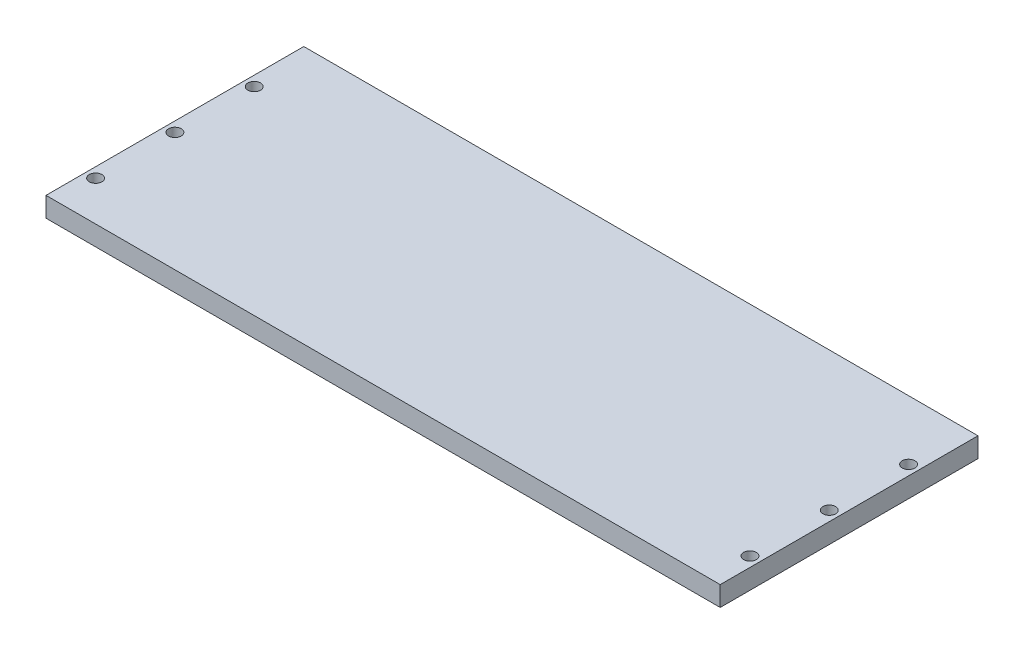
ISO-10303-21;
HEADER;
FILE_DESCRIPTION(('STEP AP214'),'2;1');
FILE_NAME('part.step','',(''),(''),'','','');
FILE_SCHEMA(('AUTOMOTIVE_DESIGN { 1 0 10303 214 1 1 1 1 }'));
ENDSEC;
DATA;
#1=APPLICATION_CONTEXT('core data for automotive mechanical design processes');
#2=APPLICATION_PROTOCOL_DEFINITION('international standard','automotive_design',2000,#1);
#3=PRODUCT_CONTEXT('',#1,'mechanical');
#4=PRODUCT('Part','Part','',(#3));
#5=PRODUCT_RELATED_PRODUCT_CATEGORY('part','',(#4));
#6=PRODUCT_DEFINITION_FORMATION('','',#4);
#7=PRODUCT_DEFINITION_CONTEXT('part definition',#1,'design');
#8=PRODUCT_DEFINITION('design','',#6,#7);
#9=PRODUCT_DEFINITION_SHAPE('','',#8);
#10=(LENGTH_UNIT() NAMED_UNIT(*) SI_UNIT(.MILLI.,.METRE.));
#11=(NAMED_UNIT(*) PLANE_ANGLE_UNIT() SI_UNIT($,.RADIAN.));
#12=(NAMED_UNIT(*) SI_UNIT($,.STERADIAN.) SOLID_ANGLE_UNIT());
#13=UNCERTAINTY_MEASURE_WITH_UNIT(LENGTH_MEASURE(1.E-05),#10,'distance_accuracy_value','');
#14=(GEOMETRIC_REPRESENTATION_CONTEXT(3) GLOBAL_UNCERTAINTY_ASSIGNED_CONTEXT((#13)) GLOBAL_UNIT_ASSIGNED_CONTEXT((#10,
#11,#12)) REPRESENTATION_CONTEXT('',''));
#15=CARTESIAN_POINT('',(0.,0.,0.));
#16=DIRECTION('',(0.,0.,1.));
#17=DIRECTION('',(1.,0.,0.));
#18=AXIS2_PLACEMENT_3D('',#15,#16,#17);
#19=CARTESIAN_POINT('',(0.,5.,0.));
#20=DIRECTION('',(0.,1.,0.));
#21=DIRECTION('',(0.,0.,1.));
#22=AXIS2_PLACEMENT_3D('',#19,#20,#21);
#23=PLANE('',#22);
#24=CARTESIAN_POINT('',(82.4999999999997,5.,2.49999999999998));
#25=DIRECTION('',(0.,1.,0.));
#26=DIRECTION('',(0.,0.,-1.));
#27=AXIS2_PLACEMENT_3D('',#24,#25,#26);
#28=CIRCLE('',#27,1.60000000000001);
#29=CARTESIAN_POINT('',(82.4999999999997,5.,0.899999999999973));
#30=VERTEX_POINT('',#29);
#31=EDGE_CURVE('E158',#30,#30,#28,.T.);
#32=ORIENTED_EDGE('',*,*,#31,.F.);
#33=EDGE_LOOP('',(#32));
#34=FACE_BOUND('',#33,.T.);
#35=CARTESIAN_POINT('',(-82.4999999999995,5.,22.5));
#36=DIRECTION('',(0.,1.,0.));
#37=DIRECTION('',(0.,0.,1.));
#38=AXIS2_PLACEMENT_3D('',#35,#36,#37);
#39=CIRCLE('',#38,1.6);
#40=CARTESIAN_POINT('',(-82.4999999999995,5.,24.1));
#41=VERTEX_POINT('',#40);
#42=EDGE_CURVE('E142',#41,#41,#39,.T.);
#43=ORIENTED_EDGE('',*,*,#42,.F.);
#44=EDGE_LOOP('',(#43));
#45=FACE_BOUND('',#44,.T.);
#46=CARTESIAN_POINT('',(-82.5,5.,-17.5));
#47=DIRECTION('',(0.,1.,0.));
#48=DIRECTION('',(0.,0.,1.));
#49=AXIS2_PLACEMENT_3D('',#46,#47,#48);
#50=CIRCLE('',#49,1.6);
#51=CARTESIAN_POINT('',(-82.5,5.,-15.9));
#52=VERTEX_POINT('',#51);
#53=EDGE_CURVE('E112',#52,#52,#50,.T.);
#54=ORIENTED_EDGE('',*,*,#53,.F.);
#55=EDGE_LOOP('',(#54));
#56=FACE_BOUND('',#55,.T.);
#57=DIRECTION('',(0.,0.,-1.));
#58=VECTOR('',#57,1.);
#59=CARTESIAN_POINT('',(85.,5.,-32.5));
#60=LINE('',#59,#58);
#61=CARTESIAN_POINT('',(85.,5.,32.5));
#62=VERTEX_POINT('',#61);
#63=CARTESIAN_POINT('',(85.,5.,-32.5));
#64=VERTEX_POINT('',#63);
#65=EDGE_CURVE('E92',#62,#64,#60,.T.);
#66=ORIENTED_EDGE('',*,*,#65,.T.);
#67=DIRECTION('',(-1.,0.,0.));
#68=VECTOR('',#67,1.);
#69=CARTESIAN_POINT('',(-85.,5.,-32.5));
#70=LINE('',#69,#68);
#71=CARTESIAN_POINT('',(-85.,5.,-32.5));
#72=VERTEX_POINT('',#71);
#73=EDGE_CURVE('E87',#64,#72,#70,.T.);
#74=ORIENTED_EDGE('',*,*,#73,.T.);
#75=DIRECTION('',(0.,0.,1.));
#76=VECTOR('',#75,1.);
#77=CARTESIAN_POINT('',(-85.,5.,-32.5));
#78=LINE('',#77,#76);
#79=CARTESIAN_POINT('',(-85.,5.,32.5));
#80=VERTEX_POINT('',#79);
#81=EDGE_CURVE('E90',#72,#80,#78,.T.);
#82=ORIENTED_EDGE('',*,*,#81,.T.);
#83=DIRECTION('',(1.,0.,0.));
#84=VECTOR('',#83,1.);
#85=CARTESIAN_POINT('',(-85.,5.,32.5));
#86=LINE('',#85,#84);
#87=EDGE_CURVE('E57',#80,#62,#86,.T.);
#88=ORIENTED_EDGE('',*,*,#87,.T.);
#89=EDGE_LOOP('',(#66,#74,#82,#88));
#90=FACE_BOUND('',#89,.T.);
#91=CARTESIAN_POINT('',(-82.4999999999998,5.,2.5));
#92=DIRECTION('',(0.,1.,0.));
#93=DIRECTION('',(0.,0.,1.));
#94=AXIS2_PLACEMENT_3D('',#91,#92,#93);
#95=CIRCLE('',#94,1.60000000000001);
#96=CARTESIAN_POINT('',(-82.4999999999998,5.,4.1));
#97=VERTEX_POINT('',#96);
#98=EDGE_CURVE('E134',#97,#97,#95,.T.);
#99=ORIENTED_EDGE('',*,*,#98,.F.);
#100=EDGE_LOOP('',(#99));
#101=FACE_BOUND('',#100,.T.);
#102=CARTESIAN_POINT('',(82.4999999999994,5.,22.5));
#103=DIRECTION('',(0.,1.,0.));
#104=DIRECTION('',(0.,0.,-1.));
#105=AXIS2_PLACEMENT_3D('',#102,#103,#104);
#106=CIRCLE('',#105,1.6);
#107=CARTESIAN_POINT('',(82.4999999999994,5.,20.9));
#108=VERTEX_POINT('',#107);
#109=EDGE_CURVE('E150',#108,#108,#106,.T.);
#110=ORIENTED_EDGE('',*,*,#109,.F.);
#111=EDGE_LOOP('',(#110));
#112=FACE_BOUND('',#111,.T.);
#113=CARTESIAN_POINT('',(82.5,5.,-17.5));
#114=DIRECTION('',(0.,1.,0.));
#115=DIRECTION('',(0.,0.,-1.));
#116=AXIS2_PLACEMENT_3D('',#113,#114,#115);
#117=CIRCLE('',#116,1.59999999999999);
#118=CARTESIAN_POINT('',(82.5,5.,-19.1));
#119=VERTEX_POINT('',#118);
#120=EDGE_CURVE('E166',#119,#119,#117,.T.);
#121=ORIENTED_EDGE('',*,*,#120,.F.);
#122=EDGE_LOOP('',(#121));
#123=FACE_BOUND('',#122,.T.);
#124=ADVANCED_FACE('F39',(#34,#45,#56,#90,#101,#112,#123),#23,.T.);
#125=CARTESIAN_POINT('',(0.,0.,0.));
#126=DIRECTION('',(0.,1.,0.));
#127=DIRECTION('',(0.,0.,1.));
#128=AXIS2_PLACEMENT_3D('',#125,#126,#127);
#129=PLANE('',#128);
#130=DIRECTION('',(0.,0.,-1.));
#131=VECTOR('',#130,1.);
#132=CARTESIAN_POINT('',(85.,0.,-32.5));
#133=LINE('',#132,#131);
#134=CARTESIAN_POINT('',(85.,0.,32.5));
#135=VERTEX_POINT('',#134);
#136=CARTESIAN_POINT('',(85.,0.,-32.5));
#137=VERTEX_POINT('',#136);
#138=EDGE_CURVE('E108',#135,#137,#133,.T.);
#139=ORIENTED_EDGE('',*,*,#138,.F.);
#140=DIRECTION('',(1.,0.,0.));
#141=VECTOR('',#140,1.);
#142=CARTESIAN_POINT('',(-85.,0.,32.5));
#143=LINE('',#142,#141);
#144=CARTESIAN_POINT('',(-85.,0.,32.5));
#145=VERTEX_POINT('',#144);
#146=EDGE_CURVE('E80',#145,#135,#143,.T.);
#147=ORIENTED_EDGE('',*,*,#146,.F.);
#148=DIRECTION('',(0.,0.,1.));
#149=VECTOR('',#148,1.);
#150=CARTESIAN_POINT('',(-85.,0.,-32.5));
#151=LINE('',#150,#149);
#152=CARTESIAN_POINT('',(-85.,0.,-32.5));
#153=VERTEX_POINT('',#152);
#154=EDGE_CURVE('E74',#153,#145,#151,.T.);
#155=ORIENTED_EDGE('',*,*,#154,.F.);
#156=DIRECTION('',(-1.,0.,0.));
#157=VECTOR('',#156,1.);
#158=CARTESIAN_POINT('',(-85.,0.,-32.5));
#159=LINE('',#158,#157);
#160=EDGE_CURVE('E97',#137,#153,#159,.T.);
#161=ORIENTED_EDGE('',*,*,#160,.F.);
#162=EDGE_LOOP('',(#139,#147,#155,#161));
#163=FACE_BOUND('',#162,.T.);
#164=CARTESIAN_POINT('',(-82.5,0.,-17.5));
#165=DIRECTION('',(0.,1.,0.));
#166=DIRECTION('',(0.,0.,1.));
#167=AXIS2_PLACEMENT_3D('',#164,#165,#166);
#168=CIRCLE('',#167,1.6);
#169=CARTESIAN_POINT('',(-82.5,0.,-15.9));
#170=VERTEX_POINT('',#169);
#171=EDGE_CURVE('E130',#170,#170,#168,.T.);
#172=ORIENTED_EDGE('',*,*,#171,.T.);
#173=EDGE_LOOP('',(#172));
#174=FACE_BOUND('',#173,.T.);
#175=CARTESIAN_POINT('',(-82.4999999999998,0.,2.5));
#176=DIRECTION('',(0.,1.,0.));
#177=DIRECTION('',(0.,0.,1.));
#178=AXIS2_PLACEMENT_3D('',#175,#176,#177);
#179=CIRCLE('',#178,1.60000000000001);
#180=CARTESIAN_POINT('',(-82.4999999999998,0.,4.1));
#181=VERTEX_POINT('',#180);
#182=EDGE_CURVE('E138',#181,#181,#179,.T.);
#183=ORIENTED_EDGE('',*,*,#182,.T.);
#184=EDGE_LOOP('',(#183));
#185=FACE_BOUND('',#184,.T.);
#186=CARTESIAN_POINT('',(-82.4999999999995,0.,22.5));
#187=DIRECTION('',(0.,1.,0.));
#188=DIRECTION('',(0.,0.,1.));
#189=AXIS2_PLACEMENT_3D('',#186,#187,#188);
#190=CIRCLE('',#189,1.6);
#191=CARTESIAN_POINT('',(-82.4999999999995,0.,24.1));
#192=VERTEX_POINT('',#191);
#193=EDGE_CURVE('E146',#192,#192,#190,.T.);
#194=ORIENTED_EDGE('',*,*,#193,.T.);
#195=EDGE_LOOP('',(#194));
#196=FACE_BOUND('',#195,.T.);
#197=CARTESIAN_POINT('',(82.4999999999994,0.,22.5));
#198=DIRECTION('',(0.,1.,0.));
#199=DIRECTION('',(0.,0.,-1.));
#200=AXIS2_PLACEMENT_3D('',#197,#198,#199);
#201=CIRCLE('',#200,1.6);
#202=CARTESIAN_POINT('',(82.4999999999994,0.,20.9));
#203=VERTEX_POINT('',#202);
#204=EDGE_CURVE('E154',#203,#203,#201,.T.);
#205=ORIENTED_EDGE('',*,*,#204,.T.);
#206=EDGE_LOOP('',(#205));
#207=FACE_BOUND('',#206,.T.);
#208=CARTESIAN_POINT('',(82.4999999999997,0.,2.49999999999998));
#209=DIRECTION('',(0.,1.,0.));
#210=DIRECTION('',(0.,0.,-1.));
#211=AXIS2_PLACEMENT_3D('',#208,#209,#210);
#212=CIRCLE('',#211,1.60000000000001);
#213=CARTESIAN_POINT('',(82.4999999999997,0.,0.899999999999973));
#214=VERTEX_POINT('',#213);
#215=EDGE_CURVE('E162',#214,#214,#212,.T.);
#216=ORIENTED_EDGE('',*,*,#215,.T.);
#217=EDGE_LOOP('',(#216));
#218=FACE_BOUND('',#217,.T.);
#219=CARTESIAN_POINT('',(82.5,0.,-17.5));
#220=DIRECTION('',(0.,1.,0.));
#221=DIRECTION('',(0.,0.,-1.));
#222=AXIS2_PLACEMENT_3D('',#219,#220,#221);
#223=CIRCLE('',#222,1.59999999999999);
#224=CARTESIAN_POINT('',(82.5,0.,-19.1));
#225=VERTEX_POINT('',#224);
#226=EDGE_CURVE('E170',#225,#225,#223,.T.);
#227=ORIENTED_EDGE('',*,*,#226,.T.);
#228=EDGE_LOOP('',(#227));
#229=FACE_BOUND('',#228,.T.);
#230=ADVANCED_FACE('F125',(#163,#174,#185,#196,#207,#218,#229),#129,.F.);
#231=CARTESIAN_POINT('',(85.,5.,-32.5));
#232=DIRECTION('',(-1.,0.,0.));
#233=DIRECTION('',(0.,0.,1.));
#234=AXIS2_PLACEMENT_3D('',#231,#232,#233);
#235=PLANE('',#234);
#236=ORIENTED_EDGE('',*,*,#138,.T.);
#237=DIRECTION('',(0.,-1.,0.));
#238=VECTOR('',#237,1.);
#239=CARTESIAN_POINT('',(85.,5.,-32.5));
#240=LINE('',#239,#238);
#241=EDGE_CURVE('E11',#64,#137,#240,.T.);
#242=ORIENTED_EDGE('',*,*,#241,.F.);
#243=ORIENTED_EDGE('',*,*,#65,.F.);
#244=DIRECTION('',(0.,-1.,0.));
#245=VECTOR('',#244,1.);
#246=CARTESIAN_POINT('',(85.,5.,32.5));
#247=LINE('',#246,#245);
#248=EDGE_CURVE('E104',#62,#135,#247,.T.);
#249=ORIENTED_EDGE('',*,*,#248,.T.);
#250=EDGE_LOOP('',(#236,#242,#243,#249));
#251=FACE_BOUND('',#250,.T.);
#252=ADVANCED_FACE('F41',(#251),#235,.F.);
#253=CARTESIAN_POINT('',(-85.,5.,-32.5));
#254=DIRECTION('',(0.,0.,1.));
#255=DIRECTION('',(1.,0.,0.));
#256=AXIS2_PLACEMENT_3D('',#253,#254,#255);
#257=PLANE('',#256);
#258=ORIENTED_EDGE('',*,*,#160,.T.);
#259=DIRECTION('',(0.,-1.,0.));
#260=VECTOR('',#259,1.);
#261=CARTESIAN_POINT('',(-85.,5.,-32.5));
#262=LINE('',#261,#260);
#263=EDGE_CURVE('E49',#72,#153,#262,.T.);
#264=ORIENTED_EDGE('',*,*,#263,.F.);
#265=ORIENTED_EDGE('',*,*,#73,.F.);
#266=ORIENTED_EDGE('',*,*,#241,.T.);
#267=EDGE_LOOP('',(#258,#264,#265,#266));
#268=FACE_BOUND('',#267,.T.);
#269=ADVANCED_FACE('F96',(#268),#257,.F.);
#270=CARTESIAN_POINT('',(-85.,5.,-32.5));
#271=DIRECTION('',(1.,0.,0.));
#272=DIRECTION('',(0.,0.,-1.));
#273=AXIS2_PLACEMENT_3D('',#270,#271,#272);
#274=PLANE('',#273);
#275=ORIENTED_EDGE('',*,*,#154,.T.);
#276=DIRECTION('',(0.,-1.,0.));
#277=VECTOR('',#276,1.);
#278=CARTESIAN_POINT('',(-85.,5.,32.5));
#279=LINE('',#278,#277);
#280=EDGE_CURVE('E99',#80,#145,#279,.T.);
#281=ORIENTED_EDGE('',*,*,#280,.F.);
#282=ORIENTED_EDGE('',*,*,#81,.F.);
#283=ORIENTED_EDGE('',*,*,#263,.T.);
#284=EDGE_LOOP('',(#275,#281,#282,#283));
#285=FACE_BOUND('',#284,.T.);
#286=ADVANCED_FACE('F100',(#285),#274,.F.);
#287=CARTESIAN_POINT('',(-85.,5.,32.5));
#288=DIRECTION('',(0.,0.,-1.));
#289=DIRECTION('',(-1.,0.,0.));
#290=AXIS2_PLACEMENT_3D('',#287,#288,#289);
#291=PLANE('',#290);
#292=ORIENTED_EDGE('',*,*,#146,.T.);
#293=ORIENTED_EDGE('',*,*,#248,.F.);
#294=ORIENTED_EDGE('',*,*,#87,.F.);
#295=ORIENTED_EDGE('',*,*,#280,.T.);
#296=EDGE_LOOP('',(#292,#293,#294,#295));
#297=FACE_BOUND('',#296,.T.);
#298=ADVANCED_FACE('F122',(#297),#291,.F.);
#299=CARTESIAN_POINT('',(-82.5,5.,-17.5));
#300=DIRECTION('',(0.,-1.,0.));
#301=DIRECTION('',(0.,0.,-1.));
#302=AXIS2_PLACEMENT_3D('',#299,#300,#301);
#303=CYLINDRICAL_SURFACE('',#302,1.6);
#304=ORIENTED_EDGE('',*,*,#53,.T.);
#305=EDGE_LOOP('',(#304));
#306=FACE_BOUND('',#305,.T.);
#307=ORIENTED_EDGE('',*,*,#171,.F.);
#308=EDGE_LOOP('',(#307));
#309=FACE_BOUND('',#308,.T.);
#310=ADVANCED_FACE('F191',(#306,#309),#303,.F.);
#311=CARTESIAN_POINT('',(-82.4999999999998,5.,2.5));
#312=DIRECTION('',(0.,-1.,0.));
#313=DIRECTION('',(0.,0.,-1.));
#314=AXIS2_PLACEMENT_3D('',#311,#312,#313);
#315=CYLINDRICAL_SURFACE('',#314,1.60000000000001);
#316=ORIENTED_EDGE('',*,*,#98,.T.);
#317=EDGE_LOOP('',(#316));
#318=FACE_BOUND('',#317,.T.);
#319=ORIENTED_EDGE('',*,*,#182,.F.);
#320=EDGE_LOOP('',(#319));
#321=FACE_BOUND('',#320,.T.);
#322=ADVANCED_FACE('F237',(#318,#321),#315,.F.);
#323=CARTESIAN_POINT('',(-82.4999999999995,5.,22.5));
#324=DIRECTION('',(0.,-1.,0.));
#325=DIRECTION('',(0.,0.,-1.));
#326=AXIS2_PLACEMENT_3D('',#323,#324,#325);
#327=CYLINDRICAL_SURFACE('',#326,1.6);
#328=ORIENTED_EDGE('',*,*,#42,.T.);
#329=EDGE_LOOP('',(#328));
#330=FACE_BOUND('',#329,.T.);
#331=ORIENTED_EDGE('',*,*,#193,.F.);
#332=EDGE_LOOP('',(#331));
#333=FACE_BOUND('',#332,.T.);
#334=ADVANCED_FACE('F245',(#330,#333),#327,.F.);
#335=CARTESIAN_POINT('',(82.4999999999994,5.,22.5));
#336=DIRECTION('',(0.,-1.,0.));
#337=DIRECTION('',(0.,0.,-1.));
#338=AXIS2_PLACEMENT_3D('',#335,#336,#337);
#339=CYLINDRICAL_SURFACE('',#338,1.6);
#340=ORIENTED_EDGE('',*,*,#109,.T.);
#341=EDGE_LOOP('',(#340));
#342=FACE_BOUND('',#341,.T.);
#343=ORIENTED_EDGE('',*,*,#204,.F.);
#344=EDGE_LOOP('',(#343));
#345=FACE_BOUND('',#344,.T.);
#346=ADVANCED_FACE('F253',(#342,#345),#339,.F.);
#347=CARTESIAN_POINT('',(82.4999999999997,5.,2.49999999999998));
#348=DIRECTION('',(0.,-1.,0.));
#349=DIRECTION('',(0.,0.,-1.));
#350=AXIS2_PLACEMENT_3D('',#347,#348,#349);
#351=CYLINDRICAL_SURFACE('',#350,1.60000000000001);
#352=ORIENTED_EDGE('',*,*,#31,.T.);
#353=EDGE_LOOP('',(#352));
#354=FACE_BOUND('',#353,.T.);
#355=ORIENTED_EDGE('',*,*,#215,.F.);
#356=EDGE_LOOP('',(#355));
#357=FACE_BOUND('',#356,.T.);
#358=ADVANCED_FACE('F262',(#354,#357),#351,.F.);
#359=CARTESIAN_POINT('',(82.5,5.,-17.5));
#360=DIRECTION('',(0.,-1.,0.));
#361=DIRECTION('',(0.,0.,-1.));
#362=AXIS2_PLACEMENT_3D('',#359,#360,#361);
#363=CYLINDRICAL_SURFACE('',#362,1.59999999999999);
#364=ORIENTED_EDGE('',*,*,#120,.T.);
#365=EDGE_LOOP('',(#364));
#366=FACE_BOUND('',#365,.T.);
#367=ORIENTED_EDGE('',*,*,#226,.F.);
#368=EDGE_LOOP('',(#367));
#369=FACE_BOUND('',#368,.T.);
#370=ADVANCED_FACE('F178',(#366,#369),#363,.F.);
#371=CLOSED_SHELL('',(#124,#230,#252,#269,#286,#298,#310,#322,#334,#346,#358,#370));
#372=MANIFOLD_SOLID_BREP('B2',#371);
#373=ADVANCED_BREP_SHAPE_REPRESENTATION('',(#18,#372),#14);
#374=SHAPE_DEFINITION_REPRESENTATION(#9,#373);
ENDSEC;
END-ISO-10303-21;
